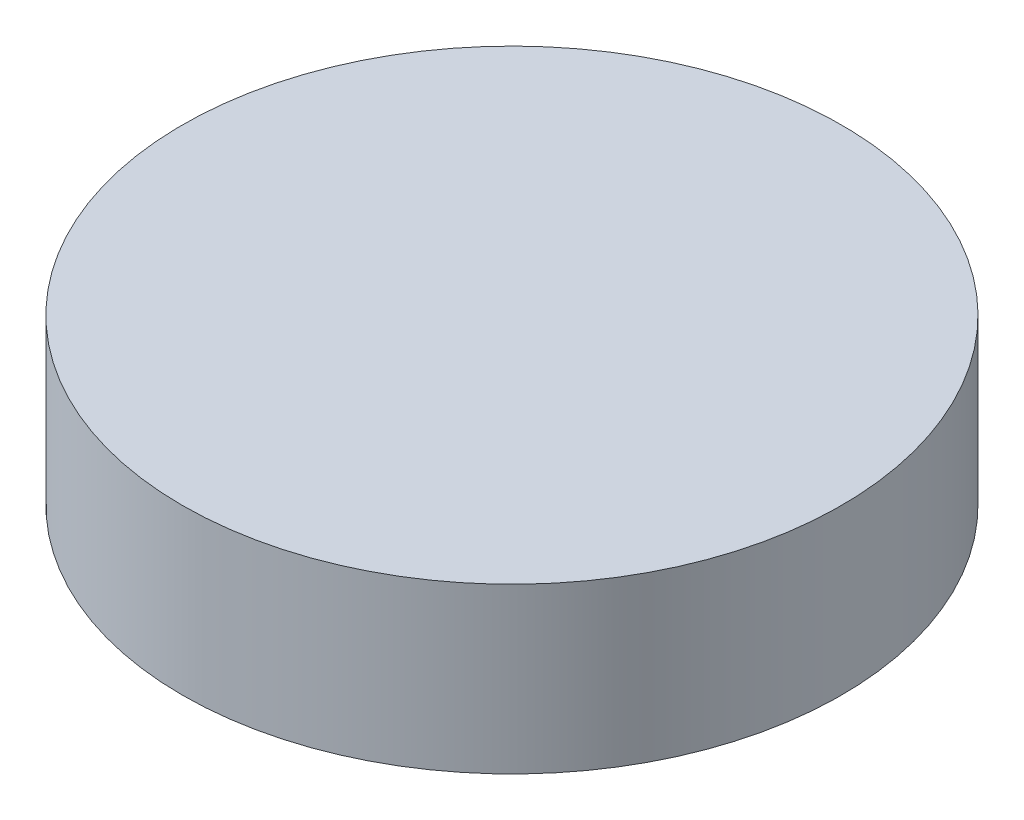
ISO-10303-21;
HEADER;
FILE_DESCRIPTION(('STEP AP214'),'2;1');
FILE_NAME('part.step','',(''),(''),'','','');
FILE_SCHEMA(('AUTOMOTIVE_DESIGN { 1 0 10303 214 1 1 1 1 }'));
ENDSEC;
DATA;
#1=APPLICATION_CONTEXT('core data for automotive mechanical design processes');
#2=APPLICATION_PROTOCOL_DEFINITION('international standard','automotive_design',2000,#1);
#3=PRODUCT_CONTEXT('',#1,'mechanical');
#4=PRODUCT('Part','Part','',(#3));
#5=PRODUCT_RELATED_PRODUCT_CATEGORY('part','',(#4));
#6=PRODUCT_DEFINITION_FORMATION('','',#4);
#7=PRODUCT_DEFINITION_CONTEXT('part definition',#1,'design');
#8=PRODUCT_DEFINITION('design','',#6,#7);
#9=PRODUCT_DEFINITION_SHAPE('','',#8);
#10=(LENGTH_UNIT() NAMED_UNIT(*) SI_UNIT(.MILLI.,.METRE.));
#11=(NAMED_UNIT(*) PLANE_ANGLE_UNIT() SI_UNIT($,.RADIAN.));
#12=(NAMED_UNIT(*) SI_UNIT($,.STERADIAN.) SOLID_ANGLE_UNIT());
#13=UNCERTAINTY_MEASURE_WITH_UNIT(LENGTH_MEASURE(1.E-05),#10,'distance_accuracy_value','');
#14=(GEOMETRIC_REPRESENTATION_CONTEXT(3) GLOBAL_UNCERTAINTY_ASSIGNED_CONTEXT((#13)) GLOBAL_UNIT_ASSIGNED_CONTEXT((#10,
#11,#12)) REPRESENTATION_CONTEXT('',''));
#15=CARTESIAN_POINT('',(0.,0.,0.));
#16=DIRECTION('',(0.,0.,1.));
#17=DIRECTION('',(1.,0.,0.));
#18=AXIS2_PLACEMENT_3D('',#15,#16,#17);
#19=CARTESIAN_POINT('',(-28.4400437460022,6.35,17.50787912232));
#20=DIRECTION('',(0.,-1.,0.));
#21=DIRECTION('',(0.,0.,-1.));
#22=AXIS2_PLACEMENT_3D('',#19,#20,#21);
#23=CYLINDRICAL_SURFACE('',#22,12.7358958673981);
#24=CARTESIAN_POINT('',(-28.4400437460022,6.35,17.50787912232));
#25=DIRECTION('',(0.,1.,0.));
#26=DIRECTION('',(0.,0.,1.));
#27=AXIS2_PLACEMENT_3D('',#24,#25,#26);
#28=CIRCLE('',#27,12.7358958673981);
#29=CARTESIAN_POINT('',(-28.4400437460022,6.35,30.2437749897181));
#30=VERTEX_POINT('',#29);
#31=EDGE_CURVE('E10',#30,#30,#28,.T.);
#32=ORIENTED_EDGE('',*,*,#31,.F.);
#33=EDGE_LOOP('',(#32));
#34=FACE_BOUND('',#33,.T.);
#35=CARTESIAN_POINT('',(-28.4400437460022,0.,17.50787912232));
#36=DIRECTION('',(0.,1.,0.));
#37=DIRECTION('',(0.,0.,1.));
#38=AXIS2_PLACEMENT_3D('',#35,#36,#37);
#39=CIRCLE('',#38,12.7358958673981);
#40=CARTESIAN_POINT('',(-28.4400437460022,0.,30.2437749897181));
#41=VERTEX_POINT('',#40);
#42=EDGE_CURVE('E33',#41,#41,#39,.T.);
#43=ORIENTED_EDGE('',*,*,#42,.T.);
#44=EDGE_LOOP('',(#43));
#45=FACE_BOUND('',#44,.T.);
#46=ADVANCED_FACE('F30',(#34,#45),#23,.T.);
#47=CARTESIAN_POINT('',(-28.4400437460022,6.35,17.50787912232));
#48=DIRECTION('',(0.,1.,0.));
#49=DIRECTION('',(0.,0.,1.));
#50=AXIS2_PLACEMENT_3D('',#47,#48,#49);
#51=PLANE('',#50);
#52=ORIENTED_EDGE('',*,*,#31,.T.);
#53=EDGE_LOOP('',(#52));
#54=FACE_BOUND('',#53,.T.);
#55=ADVANCED_FACE('F45',(#54),#51,.T.);
#56=CARTESIAN_POINT('',(-28.4400437460022,0.,17.50787912232));
#57=DIRECTION('',(0.,1.,0.));
#58=DIRECTION('',(0.,0.,1.));
#59=AXIS2_PLACEMENT_3D('',#56,#57,#58);
#60=PLANE('',#59);
#61=ORIENTED_EDGE('',*,*,#42,.F.);
#62=EDGE_LOOP('',(#61));
#63=FACE_BOUND('',#62,.T.);
#64=ADVANCED_FACE('F43',(#63),#60,.F.);
#65=CLOSED_SHELL('',(#46,#55,#64));
#66=MANIFOLD_SOLID_BREP('B2',#65);
#67=ADVANCED_BREP_SHAPE_REPRESENTATION('',(#18,#66),#14);
#68=SHAPE_DEFINITION_REPRESENTATION(#9,#67);
ENDSEC;
END-ISO-10303-21;
